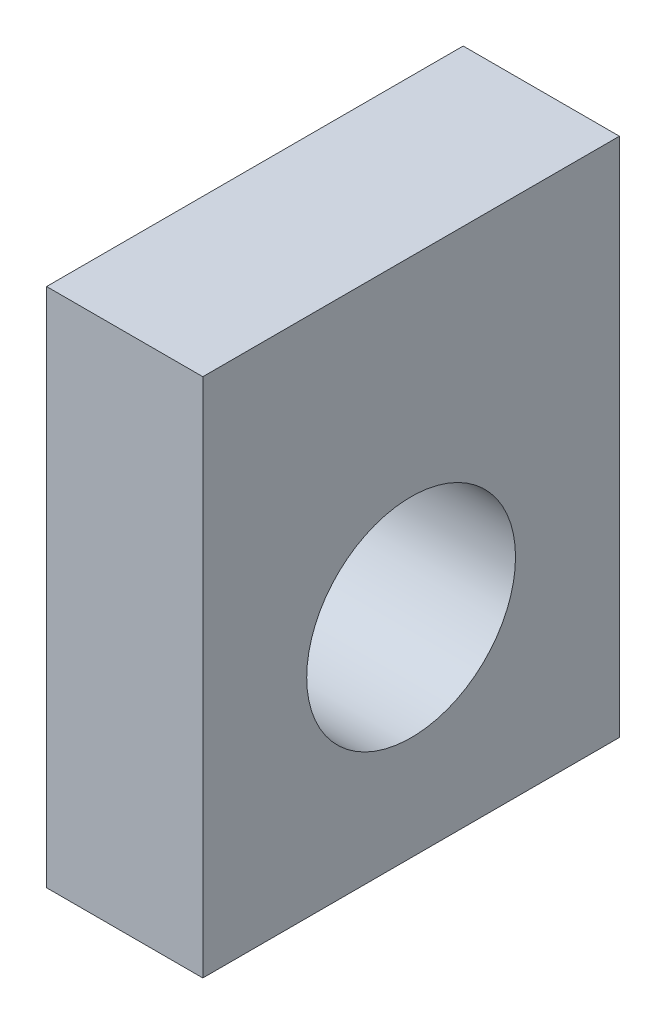
ISO-10303-21;
HEADER;
FILE_DESCRIPTION(('STEP AP214'),'2;1');
FILE_NAME('part.step','',(''),(''),'','','');
FILE_SCHEMA(('AUTOMOTIVE_DESIGN { 1 0 10303 214 1 1 1 1 }'));
ENDSEC;
DATA;
#1=APPLICATION_CONTEXT('core data for automotive mechanical design processes');
#2=APPLICATION_PROTOCOL_DEFINITION('international standard','automotive_design',2000,#1);
#3=PRODUCT_CONTEXT('',#1,'mechanical');
#4=PRODUCT('Part','Part','',(#3));
#5=PRODUCT_RELATED_PRODUCT_CATEGORY('part','',(#4));
#6=PRODUCT_DEFINITION_FORMATION('','',#4);
#7=PRODUCT_DEFINITION_CONTEXT('part definition',#1,'design');
#8=PRODUCT_DEFINITION('design','',#6,#7);
#9=PRODUCT_DEFINITION_SHAPE('','',#8);
#10=(LENGTH_UNIT() NAMED_UNIT(*) SI_UNIT(.MILLI.,.METRE.));
#11=(NAMED_UNIT(*) PLANE_ANGLE_UNIT() SI_UNIT($,.RADIAN.));
#12=(NAMED_UNIT(*) SI_UNIT($,.STERADIAN.) SOLID_ANGLE_UNIT());
#13=UNCERTAINTY_MEASURE_WITH_UNIT(LENGTH_MEASURE(1.E-05),#10,'distance_accuracy_value','');
#14=(GEOMETRIC_REPRESENTATION_CONTEXT(3) GLOBAL_UNCERTAINTY_ASSIGNED_CONTEXT((#13)) GLOBAL_UNIT_ASSIGNED_CONTEXT((#10,
#11,#12)) REPRESENTATION_CONTEXT('',''));
#15=CARTESIAN_POINT('',(0.,0.,0.));
#16=DIRECTION('',(0.,0.,1.));
#17=DIRECTION('',(1.,0.,0.));
#18=AXIS2_PLACEMENT_3D('',#15,#16,#17);
#19=CARTESIAN_POINT('',(44.9999999999999,-70.0000000000001,0.));
#20=DIRECTION('',(0.,1.00000000000001,0.));
#21=DIRECTION('',(0.,0.,0.999999999999999));
#22=AXIS2_PLACEMENT_3D('',#19,#20,#21);
#23=PLANE('',#22);
#24=DIRECTION('',(1.,0.,0.));
#25=VECTOR('',#24,1.);
#26=CARTESIAN_POINT('',(-547.5,-70.0000000000041,229.999999999999));
#27=LINE('',#26,#25);
#28=CARTESIAN_POINT('',(-562.5,-70.0000000000043,229.999999999999));
#29=VERTEX_POINT('',#28);
#30=CARTESIAN_POINT('',(-547.5,-70.0000000000041,229.999999999999));
#31=VERTEX_POINT('',#30);
#32=EDGE_CURVE('E76',#29,#31,#27,.T.);
#33=ORIENTED_EDGE('',*,*,#32,.T.);
#34=DIRECTION('',(0.,0.,0.999999999999999));
#35=VECTOR('',#34,1.);
#36=CARTESIAN_POINT('',(-547.5,-70.0000000000041,229.999999999999));
#37=LINE('',#36,#35);
#38=CARTESIAN_POINT('',(-547.499999999997,-69.9999999999998,270.000000000001));
#39=VERTEX_POINT('',#38);
#40=EDGE_CURVE('E72',#31,#39,#37,.T.);
#41=ORIENTED_EDGE('',*,*,#40,.T.);
#42=DIRECTION('',(-1.,0.,0.));
#43=VECTOR('',#42,1.);
#44=CARTESIAN_POINT('',(-562.499999999997,-70.0000000000001,270.));
#45=LINE('',#44,#43);
#46=CARTESIAN_POINT('',(-562.499999999997,-70.0000000000001,270.));
#47=VERTEX_POINT('',#46);
#48=EDGE_CURVE('E90',#39,#47,#45,.T.);
#49=ORIENTED_EDGE('',*,*,#48,.T.);
#50=DIRECTION('',(0.,0.,-0.999999999999999));
#51=VECTOR('',#50,1.);
#52=CARTESIAN_POINT('',(-562.5,-70.0000000000043,229.999999999999));
#53=LINE('',#52,#51);
#54=EDGE_CURVE('E77',#47,#29,#53,.T.);
#55=ORIENTED_EDGE('',*,*,#54,.T.);
#56=EDGE_LOOP('',(#33,#41,#49,#55));
#57=FACE_BOUND('',#56,.T.);
#58=ADVANCED_FACE('F36',(#57),#23,.F.);
#59=CARTESIAN_POINT('',(70.0000000000007,-19.9999999999998,249.999999999999));
#60=DIRECTION('',(0.,-1.00000000000001,0.));
#61=DIRECTION('',(0.,0.,-0.999999999999999));
#62=AXIS2_PLACEMENT_3D('',#59,#60,#61);
#63=PLANE('',#62);
#64=DIRECTION('',(0.,0.,-0.999999999999999));
#65=VECTOR('',#64,1.);
#66=CARTESIAN_POINT('',(-562.5,-20.0000000000042,229.999999999999));
#67=LINE('',#66,#65);
#68=CARTESIAN_POINT('',(-562.499999999998,-20.,269.999999999999));
#69=VERTEX_POINT('',#68);
#70=CARTESIAN_POINT('',(-562.5,-20.0000000000042,229.999999999999));
#71=VERTEX_POINT('',#70);
#72=EDGE_CURVE('E11',#69,#71,#67,.T.);
#73=ORIENTED_EDGE('',*,*,#72,.F.);
#74=DIRECTION('',(-1.,0.,0.));
#75=VECTOR('',#74,1.);
#76=CARTESIAN_POINT('',(-562.499999999998,-20.,269.999999999999));
#77=LINE('',#76,#75);
#78=CARTESIAN_POINT('',(-547.499999999997,-19.9999999999998,269.999999999999));
#79=VERTEX_POINT('',#78);
#80=EDGE_CURVE('E101',#79,#69,#77,.T.);
#81=ORIENTED_EDGE('',*,*,#80,.F.);
#82=DIRECTION('',(0.,0.,0.999999999999999));
#83=VECTOR('',#82,1.);
#84=CARTESIAN_POINT('',(-547.5,-20.0000000000042,229.999999999999));
#85=LINE('',#84,#83);
#86=CARTESIAN_POINT('',(-547.5,-20.0000000000042,229.999999999999));
#87=VERTEX_POINT('',#86);
#88=EDGE_CURVE('E96',#87,#79,#85,.T.);
#89=ORIENTED_EDGE('',*,*,#88,.F.);
#90=DIRECTION('',(1.,0.,0.));
#91=VECTOR('',#90,1.);
#92=CARTESIAN_POINT('',(-547.5,-20.0000000000042,229.999999999999));
#93=LINE('',#92,#91);
#94=EDGE_CURVE('E95',#71,#87,#93,.T.);
#95=ORIENTED_EDGE('',*,*,#94,.F.);
#96=EDGE_LOOP('',(#73,#81,#89,#95));
#97=FACE_BOUND('',#96,.T.);
#98=ADVANCED_FACE('F111',(#97),#63,.F.);
#99=CARTESIAN_POINT('',(-547.5,-70.0000000000041,229.999999999999));
#100=DIRECTION('',(0.,0.,0.999999999999999));
#101=DIRECTION('',(1.,0.,0.));
#102=AXIS2_PLACEMENT_3D('',#99,#100,#101);
#103=PLANE('',#102);
#104=DIRECTION('',(0.,1.00000000000001,0.));
#105=VECTOR('',#104,1.);
#106=CARTESIAN_POINT('',(-547.5,-70.0000000000041,229.999999999999));
#107=LINE('',#106,#105);
#108=EDGE_CURVE('E86',#31,#87,#107,.T.);
#109=ORIENTED_EDGE('',*,*,#108,.F.);
#110=ORIENTED_EDGE('',*,*,#32,.F.);
#111=DIRECTION('',(0.,1.00000000000001,0.));
#112=VECTOR('',#111,1.);
#113=CARTESIAN_POINT('',(-562.5,-70.0000000000043,229.999999999999));
#114=LINE('',#113,#112);
#115=EDGE_CURVE('E39',#29,#71,#114,.T.);
#116=ORIENTED_EDGE('',*,*,#115,.T.);
#117=ORIENTED_EDGE('',*,*,#94,.T.);
#118=EDGE_LOOP('',(#109,#110,#116,#117));
#119=FACE_BOUND('',#118,.T.);
#120=ADVANCED_FACE('F93',(#119),#103,.F.);
#121=CARTESIAN_POINT('',(-547.5,-70.0000000000041,229.999999999999));
#122=DIRECTION('',(-1.,0.,0.));
#123=DIRECTION('',(0.,0.,0.999999999999999));
#124=AXIS2_PLACEMENT_3D('',#121,#122,#123);
#125=PLANE('',#124);
#126=CARTESIAN_POINT('',(-547.499999999998,-50.,249.999999999999));
#127=DIRECTION('',(-1.,0.,0.));
#128=DIRECTION('',(0.,0.,0.999999999999999));
#129=AXIS2_PLACEMENT_3D('',#126,#127,#128);
#130=CIRCLE('',#129,10.0249999999998);
#131=CARTESIAN_POINT('',(-547.499999999998,-50.,260.024999999999));
#132=VERTEX_POINT('',#131);
#133=EDGE_CURVE('E81',#132,#132,#130,.T.);
#134=ORIENTED_EDGE('',*,*,#133,.T.);
#135=EDGE_LOOP('',(#134));
#136=FACE_BOUND('',#135,.T.);
#137=DIRECTION('',(0.,1.00000000000001,0.));
#138=VECTOR('',#137,1.);
#139=CARTESIAN_POINT('',(-547.499999999997,-69.9999999999998,270.000000000001));
#140=LINE('',#139,#138);
#141=EDGE_CURVE('E88',#39,#79,#140,.T.);
#142=ORIENTED_EDGE('',*,*,#141,.F.);
#143=ORIENTED_EDGE('',*,*,#40,.F.);
#144=ORIENTED_EDGE('',*,*,#108,.T.);
#145=ORIENTED_EDGE('',*,*,#88,.T.);
#146=EDGE_LOOP('',(#142,#143,#144,#145));
#147=FACE_BOUND('',#146,.T.);
#148=ADVANCED_FACE('F84',(#136,#147),#125,.F.);
#149=CARTESIAN_POINT('',(-562.499999999997,-70.0000000000001,270.));
#150=DIRECTION('',(0.,0.,-0.999999999999999));
#151=DIRECTION('',(-1.,0.,0.));
#152=AXIS2_PLACEMENT_3D('',#149,#150,#151);
#153=PLANE('',#152);
#154=DIRECTION('',(0.,1.00000000000001,0.));
#155=VECTOR('',#154,1.);
#156=CARTESIAN_POINT('',(-562.499999999997,-70.0000000000001,270.));
#157=LINE('',#156,#155);
#158=EDGE_CURVE('E45',#47,#69,#157,.T.);
#159=ORIENTED_EDGE('',*,*,#158,.F.);
#160=ORIENTED_EDGE('',*,*,#48,.F.);
#161=ORIENTED_EDGE('',*,*,#141,.T.);
#162=ORIENTED_EDGE('',*,*,#80,.T.);
#163=EDGE_LOOP('',(#159,#160,#161,#162));
#164=FACE_BOUND('',#163,.T.);
#165=ADVANCED_FACE('F108',(#164),#153,.F.);
#166=CARTESIAN_POINT('',(-562.5,-70.0000000000043,229.999999999999));
#167=DIRECTION('',(1.,0.,0.));
#168=DIRECTION('',(0.,0.,-0.999999999999999));
#169=AXIS2_PLACEMENT_3D('',#166,#167,#168);
#170=PLANE('',#169);
#171=CARTESIAN_POINT('',(-562.499999999998,-50.,250.));
#172=DIRECTION('',(-1.,0.,0.));
#173=DIRECTION('',(0.,0.,0.999999999999999));
#174=AXIS2_PLACEMENT_3D('',#171,#172,#173);
#175=CIRCLE('',#174,10.0249999999998);
#176=CARTESIAN_POINT('',(-562.499999999998,-50.,260.024999999999));
#177=VERTEX_POINT('',#176);
#178=EDGE_CURVE('E133',#177,#177,#175,.T.);
#179=ORIENTED_EDGE('',*,*,#178,.F.);
#180=EDGE_LOOP('',(#179));
#181=FACE_BOUND('',#180,.T.);
#182=ORIENTED_EDGE('',*,*,#115,.F.);
#183=ORIENTED_EDGE('',*,*,#54,.F.);
#184=ORIENTED_EDGE('',*,*,#158,.T.);
#185=ORIENTED_EDGE('',*,*,#72,.T.);
#186=EDGE_LOOP('',(#182,#183,#184,#185));
#187=FACE_BOUND('',#186,.T.);
#188=ADVANCED_FACE('F109',(#181,#187),#170,.F.);
#189=CARTESIAN_POINT('',(-562.499999999998,-50.,250.));
#190=DIRECTION('',(-1.,0.,0.));
#191=DIRECTION('',(0.,0.,0.999999999999999));
#192=AXIS2_PLACEMENT_3D('',#189,#190,#191);
#193=CYLINDRICAL_SURFACE('',#192,10.0249999999998);
#194=ORIENTED_EDGE('',*,*,#178,.T.);
#195=EDGE_LOOP('',(#194));
#196=FACE_BOUND('',#195,.T.);
#197=ORIENTED_EDGE('',*,*,#133,.F.);
#198=EDGE_LOOP('',(#197));
#199=FACE_BOUND('',#198,.T.);
#200=ADVANCED_FACE('F120',(#196,#199),#193,.F.);
#201=CLOSED_SHELL('',(#58,#98,#120,#148,#165,#188,#200));
#202=MANIFOLD_SOLID_BREP('B2',#201);
#203=ADVANCED_BREP_SHAPE_REPRESENTATION('',(#18,#202),#14);
#204=SHAPE_DEFINITION_REPRESENTATION(#9,#203);
ENDSEC;
END-ISO-10303-21;
